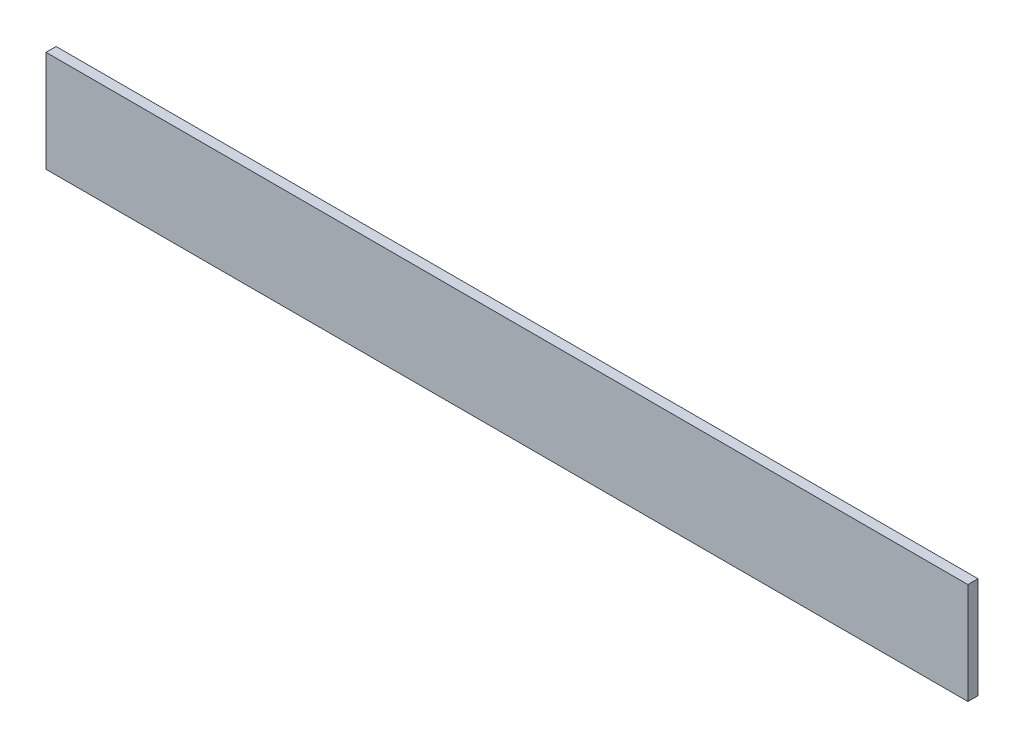
ISO-10303-21;
HEADER;
FILE_DESCRIPTION(('STEP AP214'),'2;1');
FILE_NAME('part.step','',(''),(''),'','','');
FILE_SCHEMA(('AUTOMOTIVE_DESIGN { 1 0 10303 214 1 1 1 1 }'));
ENDSEC;
DATA;
#1=APPLICATION_CONTEXT('core data for automotive mechanical design processes');
#2=APPLICATION_PROTOCOL_DEFINITION('international standard','automotive_design',2000,#1);
#3=PRODUCT_CONTEXT('',#1,'mechanical');
#4=PRODUCT('Part','Part','',(#3));
#5=PRODUCT_RELATED_PRODUCT_CATEGORY('part','',(#4));
#6=PRODUCT_DEFINITION_FORMATION('','',#4);
#7=PRODUCT_DEFINITION_CONTEXT('part definition',#1,'design');
#8=PRODUCT_DEFINITION('design','',#6,#7);
#9=PRODUCT_DEFINITION_SHAPE('','',#8);
#10=(LENGTH_UNIT() NAMED_UNIT(*) SI_UNIT(.MILLI.,.METRE.));
#11=(NAMED_UNIT(*) PLANE_ANGLE_UNIT() SI_UNIT($,.RADIAN.));
#12=(NAMED_UNIT(*) SI_UNIT($,.STERADIAN.) SOLID_ANGLE_UNIT());
#13=UNCERTAINTY_MEASURE_WITH_UNIT(LENGTH_MEASURE(1.E-05),#10,'distance_accuracy_value','');
#14=(GEOMETRIC_REPRESENTATION_CONTEXT(3) GLOBAL_UNCERTAINTY_ASSIGNED_CONTEXT((#13)) GLOBAL_UNIT_ASSIGNED_CONTEXT((#10,
#11,#12)) REPRESENTATION_CONTEXT('',''));
#15=CARTESIAN_POINT('',(0.,0.,0.));
#16=DIRECTION('',(0.,0.,1.));
#17=DIRECTION('',(1.,0.,0.));
#18=AXIS2_PLACEMENT_3D('',#15,#16,#17);
#19=CARTESIAN_POINT('',(-256.320766404648,10.4707792207792,3.));
#20=DIRECTION('',(1.,0.,0.));
#21=DIRECTION('',(0.,0.,-1.));
#22=AXIS2_PLACEMENT_3D('',#19,#20,#21);
#23=PLANE('',#22);
#24=DIRECTION('',(0.,-1.,0.));
#25=VECTOR('',#24,1.);
#26=CARTESIAN_POINT('',(-256.320766404648,10.4707792207792,0.));
#27=LINE('',#26,#25);
#28=CARTESIAN_POINT('',(-256.320766404648,10.4707792207792,0.));
#29=VERTEX_POINT('',#28);
#30=CARTESIAN_POINT('',(-256.320766404648,-19.5292207792208,0.));
#31=VERTEX_POINT('',#30);
#32=EDGE_CURVE('E96',#29,#31,#27,.T.);
#33=ORIENTED_EDGE('',*,*,#32,.T.);
#34=DIRECTION('',(0.,0.,-1.));
#35=VECTOR('',#34,1.);
#36=CARTESIAN_POINT('',(-256.320766404648,-19.5292207792208,3.));
#37=LINE('',#36,#35);
#38=CARTESIAN_POINT('',(-256.320766404648,-19.5292207792208,3.));
#39=VERTEX_POINT('',#38);
#40=EDGE_CURVE('E11',#39,#31,#37,.T.);
#41=ORIENTED_EDGE('',*,*,#40,.F.);
#42=DIRECTION('',(0.,-1.,0.));
#43=VECTOR('',#42,1.);
#44=CARTESIAN_POINT('',(-256.320766404648,10.4707792207792,3.));
#45=LINE('',#44,#43);
#46=CARTESIAN_POINT('',(-256.320766404648,10.4707792207792,3.));
#47=VERTEX_POINT('',#46);
#48=EDGE_CURVE('E84',#47,#39,#45,.T.);
#49=ORIENTED_EDGE('',*,*,#48,.F.);
#50=DIRECTION('',(0.,0.,-1.));
#51=VECTOR('',#50,1.);
#52=CARTESIAN_POINT('',(-256.320766404648,10.4707792207792,3.));
#53=LINE('',#52,#51);
#54=EDGE_CURVE('E92',#47,#29,#53,.T.);
#55=ORIENTED_EDGE('',*,*,#54,.T.);
#56=EDGE_LOOP('',(#33,#41,#49,#55));
#57=FACE_BOUND('',#56,.T.);
#58=ADVANCED_FACE('F33',(#57),#23,.F.);
#59=CARTESIAN_POINT('',(-256.320766404648,-19.5292207792208,3.));
#60=DIRECTION('',(0.,1.,0.));
#61=DIRECTION('',(0.,0.,1.));
#62=AXIS2_PLACEMENT_3D('',#59,#60,#61);
#63=PLANE('',#62);
#64=DIRECTION('',(1.,0.,0.));
#65=VECTOR('',#64,1.);
#66=CARTESIAN_POINT('',(-256.320766404648,-19.5292207792208,0.));
#67=LINE('',#66,#65);
#68=CARTESIAN_POINT('',(16.679233595352,-19.5292207792208,0.));
#69=VERTEX_POINT('',#68);
#70=EDGE_CURVE('E88',#31,#69,#67,.T.);
#71=ORIENTED_EDGE('',*,*,#70,.T.);
#72=DIRECTION('',(0.,0.,-1.));
#73=VECTOR('',#72,1.);
#74=CARTESIAN_POINT('',(16.679233595352,-19.5292207792208,3.));
#75=LINE('',#74,#73);
#76=CARTESIAN_POINT('',(16.679233595352,-19.5292207792208,3.));
#77=VERTEX_POINT('',#76);
#78=EDGE_CURVE('E41',#77,#69,#75,.T.);
#79=ORIENTED_EDGE('',*,*,#78,.F.);
#80=DIRECTION('',(1.,0.,0.));
#81=VECTOR('',#80,1.);
#82=CARTESIAN_POINT('',(-256.320766404648,-19.5292207792208,3.));
#83=LINE('',#82,#81);
#84=EDGE_CURVE('E79',#39,#77,#83,.T.);
#85=ORIENTED_EDGE('',*,*,#84,.F.);
#86=ORIENTED_EDGE('',*,*,#40,.T.);
#87=EDGE_LOOP('',(#71,#79,#85,#86));
#88=FACE_BOUND('',#87,.T.);
#89=ADVANCED_FACE('F87',(#88),#63,.F.);
#90=CARTESIAN_POINT('',(16.679233595352,10.4707792207792,3.));
#91=DIRECTION('',(-1.,0.,0.));
#92=DIRECTION('',(0.,0.,1.));
#93=AXIS2_PLACEMENT_3D('',#90,#91,#92);
#94=PLANE('',#93);
#95=DIRECTION('',(0.,1.,0.));
#96=VECTOR('',#95,1.);
#97=CARTESIAN_POINT('',(16.679233595352,10.4707792207792,0.));
#98=LINE('',#97,#96);
#99=CARTESIAN_POINT('',(16.679233595352,10.4707792207792,0.));
#100=VERTEX_POINT('',#99);
#101=EDGE_CURVE('E66',#69,#100,#98,.T.);
#102=ORIENTED_EDGE('',*,*,#101,.T.);
#103=DIRECTION('',(0.,0.,-1.));
#104=VECTOR('',#103,1.);
#105=CARTESIAN_POINT('',(16.679233595352,10.4707792207792,3.));
#106=LINE('',#105,#104);
#107=CARTESIAN_POINT('',(16.679233595352,10.4707792207792,3.));
#108=VERTEX_POINT('',#107);
#109=EDGE_CURVE('E89',#108,#100,#106,.T.);
#110=ORIENTED_EDGE('',*,*,#109,.F.);
#111=DIRECTION('',(0.,1.,0.));
#112=VECTOR('',#111,1.);
#113=CARTESIAN_POINT('',(16.679233595352,10.4707792207792,3.));
#114=LINE('',#113,#112);
#115=EDGE_CURVE('E82',#77,#108,#114,.T.);
#116=ORIENTED_EDGE('',*,*,#115,.F.);
#117=ORIENTED_EDGE('',*,*,#78,.T.);
#118=EDGE_LOOP('',(#102,#110,#116,#117));
#119=FACE_BOUND('',#118,.T.);
#120=ADVANCED_FACE('F90',(#119),#94,.F.);
#121=CARTESIAN_POINT('',(-256.320766404648,10.4707792207792,3.));
#122=DIRECTION('',(0.,-1.,0.));
#123=DIRECTION('',(0.,0.,-1.));
#124=AXIS2_PLACEMENT_3D('',#121,#122,#123);
#125=PLANE('',#124);
#126=DIRECTION('',(-1.,0.,0.));
#127=VECTOR('',#126,1.);
#128=CARTESIAN_POINT('',(-256.320766404648,10.4707792207792,0.));
#129=LINE('',#128,#127);
#130=EDGE_CURVE('E72',#100,#29,#129,.T.);
#131=ORIENTED_EDGE('',*,*,#130,.T.);
#132=ORIENTED_EDGE('',*,*,#54,.F.);
#133=DIRECTION('',(-1.,0.,0.));
#134=VECTOR('',#133,1.);
#135=CARTESIAN_POINT('',(-256.320766404648,10.4707792207792,3.));
#136=LINE('',#135,#134);
#137=EDGE_CURVE('E49',#108,#47,#136,.T.);
#138=ORIENTED_EDGE('',*,*,#137,.F.);
#139=ORIENTED_EDGE('',*,*,#109,.T.);
#140=EDGE_LOOP('',(#131,#132,#138,#139));
#141=FACE_BOUND('',#140,.T.);
#142=ADVANCED_FACE('F103',(#141),#125,.F.);
#143=CARTESIAN_POINT('',(0.,0.,3.));
#144=DIRECTION('',(0.,0.,1.));
#145=DIRECTION('',(1.,0.,0.));
#146=AXIS2_PLACEMENT_3D('',#143,#144,#145);
#147=PLANE('',#146);
#148=ORIENTED_EDGE('',*,*,#48,.T.);
#149=ORIENTED_EDGE('',*,*,#84,.T.);
#150=ORIENTED_EDGE('',*,*,#115,.T.);
#151=ORIENTED_EDGE('',*,*,#137,.T.);
#152=EDGE_LOOP('',(#148,#149,#150,#151));
#153=FACE_BOUND('',#152,.T.);
#154=ADVANCED_FACE('F80',(#153),#147,.T.);
#155=CARTESIAN_POINT('',(0.,0.,0.));
#156=DIRECTION('',(0.,0.,1.));
#157=DIRECTION('',(1.,0.,0.));
#158=AXIS2_PLACEMENT_3D('',#155,#156,#157);
#159=PLANE('',#158);
#160=ORIENTED_EDGE('',*,*,#32,.F.);
#161=ORIENTED_EDGE('',*,*,#130,.F.);
#162=ORIENTED_EDGE('',*,*,#101,.F.);
#163=ORIENTED_EDGE('',*,*,#70,.F.);
#164=EDGE_LOOP('',(#160,#161,#162,#163));
#165=FACE_BOUND('',#164,.T.);
#166=ADVANCED_FACE('F106',(#165),#159,.F.);
#167=CLOSED_SHELL('',(#58,#89,#120,#142,#154,#166));
#168=MANIFOLD_SOLID_BREP('B2',#167);
#169=ADVANCED_BREP_SHAPE_REPRESENTATION('',(#18,#168),#14);
#170=SHAPE_DEFINITION_REPRESENTATION(#9,#169);
ENDSEC;
END-ISO-10303-21;
